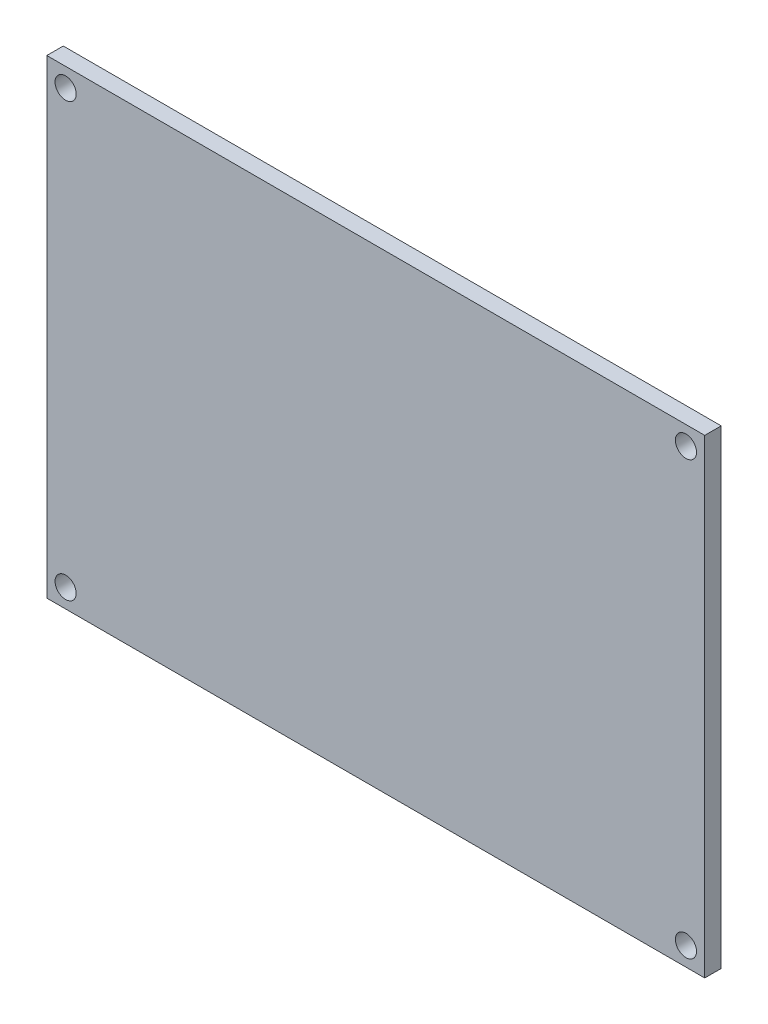
ISO-10303-21;
HEADER;
FILE_DESCRIPTION(('STEP AP214'),'2;1');
FILE_NAME('part.step','',(''),(''),'','','');
FILE_SCHEMA(('AUTOMOTIVE_DESIGN { 1 0 10303 214 1 1 1 1 }'));
ENDSEC;
DATA;
#1=APPLICATION_CONTEXT('core data for automotive mechanical design processes');
#2=APPLICATION_PROTOCOL_DEFINITION('international standard','automotive_design',2000,#1);
#3=PRODUCT_CONTEXT('',#1,'mechanical');
#4=PRODUCT('Part','Part','',(#3));
#5=PRODUCT_RELATED_PRODUCT_CATEGORY('part','',(#4));
#6=PRODUCT_DEFINITION_FORMATION('','',#4);
#7=PRODUCT_DEFINITION_CONTEXT('part definition',#1,'design');
#8=PRODUCT_DEFINITION('design','',#6,#7);
#9=PRODUCT_DEFINITION_SHAPE('','',#8);
#10=(LENGTH_UNIT() NAMED_UNIT(*) SI_UNIT(.MILLI.,.METRE.));
#11=(NAMED_UNIT(*) PLANE_ANGLE_UNIT() SI_UNIT($,.RADIAN.));
#12=(NAMED_UNIT(*) SI_UNIT($,.STERADIAN.) SOLID_ANGLE_UNIT());
#13=UNCERTAINTY_MEASURE_WITH_UNIT(LENGTH_MEASURE(1.E-05),#10,'distance_accuracy_value','');
#14=(GEOMETRIC_REPRESENTATION_CONTEXT(3) GLOBAL_UNCERTAINTY_ASSIGNED_CONTEXT((#13)) GLOBAL_UNIT_ASSIGNED_CONTEXT((#10,
#11,#12)) REPRESENTATION_CONTEXT('',''));
#15=CARTESIAN_POINT('',(0.,0.,0.));
#16=DIRECTION('',(0.,0.,1.));
#17=DIRECTION('',(1.,0.,0.));
#18=AXIS2_PLACEMENT_3D('',#15,#16,#17);
#19=CARTESIAN_POINT('',(0.,0.,1.75));
#20=DIRECTION('',(0.,0.,-1.));
#21=DIRECTION('',(-1.,0.,0.));
#22=AXIS2_PLACEMENT_3D('',#19,#20,#21);
#23=PLANE('',#22);
#24=DIRECTION('',(0.,1.,0.));
#25=VECTOR('',#24,1.);
#26=CARTESIAN_POINT('',(35.,-25.,1.75));
#27=LINE('',#26,#25);
#28=CARTESIAN_POINT('',(35.,-25.,1.75));
#29=VERTEX_POINT('',#28);
#30=CARTESIAN_POINT('',(35.,25.,1.75));
#31=VERTEX_POINT('',#30);
#32=EDGE_CURVE('E85',#29,#31,#27,.T.);
#33=ORIENTED_EDGE('',*,*,#32,.T.);
#34=DIRECTION('',(-1.,0.,0.));
#35=VECTOR('',#34,1.);
#36=CARTESIAN_POINT('',(-35.,25.,1.75));
#37=LINE('',#36,#35);
#38=CARTESIAN_POINT('',(-35.,25.,1.75));
#39=VERTEX_POINT('',#38);
#40=EDGE_CURVE('E80',#31,#39,#37,.T.);
#41=ORIENTED_EDGE('',*,*,#40,.T.);
#42=DIRECTION('',(0.,-1.,0.));
#43=VECTOR('',#42,1.);
#44=CARTESIAN_POINT('',(-35.,-25.,1.75));
#45=LINE('',#44,#43);
#46=CARTESIAN_POINT('',(-35.,-25.,1.75));
#47=VERTEX_POINT('',#46);
#48=EDGE_CURVE('E83',#39,#47,#45,.T.);
#49=ORIENTED_EDGE('',*,*,#48,.T.);
#50=DIRECTION('',(1.,0.,0.));
#51=VECTOR('',#50,1.);
#52=CARTESIAN_POINT('',(-35.,-25.,1.75));
#53=LINE('',#52,#51);
#54=EDGE_CURVE('E50',#47,#29,#53,.T.);
#55=ORIENTED_EDGE('',*,*,#54,.T.);
#56=EDGE_LOOP('',(#33,#41,#49,#55));
#57=FACE_BOUND('',#56,.T.);
#58=CARTESIAN_POINT('',(-33.,23.,1.75));
#59=DIRECTION('',(0.,0.,1.));
#60=DIRECTION('',(1.,0.,0.));
#61=AXIS2_PLACEMENT_3D('',#58,#59,#60);
#62=CIRCLE('',#61,1.125);
#63=CARTESIAN_POINT('',(-31.875,23.,1.75));
#64=VERTEX_POINT('',#63);
#65=EDGE_CURVE('E100',#64,#64,#62,.T.);
#66=ORIENTED_EDGE('',*,*,#65,.F.);
#67=EDGE_LOOP('',(#66));
#68=FACE_BOUND('',#67,.T.);
#69=CARTESIAN_POINT('',(33.,23.,1.75));
#70=DIRECTION('',(0.,0.,1.));
#71=DIRECTION('',(1.,0.,0.));
#72=AXIS2_PLACEMENT_3D('',#69,#70,#71);
#73=CIRCLE('',#72,1.125);
#74=CARTESIAN_POINT('',(34.125,23.,1.75));
#75=VERTEX_POINT('',#74);
#76=EDGE_CURVE('E115',#75,#75,#73,.T.);
#77=ORIENTED_EDGE('',*,*,#76,.F.);
#78=EDGE_LOOP('',(#77));
#79=FACE_BOUND('',#78,.T.);
#80=CARTESIAN_POINT('',(33.,-23.,1.75));
#81=DIRECTION('',(0.,0.,1.));
#82=DIRECTION('',(1.,0.,0.));
#83=AXIS2_PLACEMENT_3D('',#80,#81,#82);
#84=CIRCLE('',#83,1.125);
#85=CARTESIAN_POINT('',(34.125,-23.,1.75));
#86=VERTEX_POINT('',#85);
#87=EDGE_CURVE('E121',#86,#86,#84,.T.);
#88=ORIENTED_EDGE('',*,*,#87,.F.);
#89=EDGE_LOOP('',(#88));
#90=FACE_BOUND('',#89,.T.);
#91=CARTESIAN_POINT('',(-33.,-23.,1.75));
#92=DIRECTION('',(0.,0.,1.));
#93=DIRECTION('',(1.,0.,0.));
#94=AXIS2_PLACEMENT_3D('',#91,#92,#93);
#95=CIRCLE('',#94,1.125);
#96=CARTESIAN_POINT('',(-31.875,-23.,1.75));
#97=VERTEX_POINT('',#96);
#98=EDGE_CURVE('E127',#97,#97,#95,.T.);
#99=ORIENTED_EDGE('',*,*,#98,.F.);
#100=EDGE_LOOP('',(#99));
#101=FACE_BOUND('',#100,.T.);
#102=ADVANCED_FACE('F33',(#57,#68,#79,#90,#101),#23,.F.);
#103=CARTESIAN_POINT('',(0.,0.,0.));
#104=DIRECTION('',(0.,0.,-1.));
#105=DIRECTION('',(-1.,0.,0.));
#106=AXIS2_PLACEMENT_3D('',#103,#104,#105);
#107=PLANE('',#106);
#108=CARTESIAN_POINT('',(33.,-23.,0.));
#109=DIRECTION('',(0.,0.,1.));
#110=DIRECTION('',(1.,0.,0.));
#111=AXIS2_PLACEMENT_3D('',#108,#109,#110);
#112=CIRCLE('',#111,1.125);
#113=CARTESIAN_POINT('',(34.125,-23.,0.));
#114=VERTEX_POINT('',#113);
#115=EDGE_CURVE('E124',#114,#114,#112,.T.);
#116=ORIENTED_EDGE('',*,*,#115,.T.);
#117=EDGE_LOOP('',(#116));
#118=FACE_BOUND('',#117,.T.);
#119=CARTESIAN_POINT('',(-33.,23.,0.));
#120=DIRECTION('',(0.,0.,1.));
#121=DIRECTION('',(1.,0.,0.));
#122=AXIS2_PLACEMENT_3D('',#119,#120,#121);
#123=CIRCLE('',#122,1.125);
#124=CARTESIAN_POINT('',(-31.875,23.,0.));
#125=VERTEX_POINT('',#124);
#126=EDGE_CURVE('E112',#125,#125,#123,.T.);
#127=ORIENTED_EDGE('',*,*,#126,.T.);
#128=EDGE_LOOP('',(#127));
#129=FACE_BOUND('',#128,.T.);
#130=DIRECTION('',(0.,1.,0.));
#131=VECTOR('',#130,1.);
#132=CARTESIAN_POINT('',(35.,-25.,0.));
#133=LINE('',#132,#131);
#134=CARTESIAN_POINT('',(35.,-25.,0.));
#135=VERTEX_POINT('',#134);
#136=CARTESIAN_POINT('',(35.,25.,0.));
#137=VERTEX_POINT('',#136);
#138=EDGE_CURVE('E97',#135,#137,#133,.T.);
#139=ORIENTED_EDGE('',*,*,#138,.F.);
#140=DIRECTION('',(1.,0.,0.));
#141=VECTOR('',#140,1.);
#142=CARTESIAN_POINT('',(-35.,-25.,0.));
#143=LINE('',#142,#141);
#144=CARTESIAN_POINT('',(-35.,-25.,0.));
#145=VERTEX_POINT('',#144);
#146=EDGE_CURVE('E73',#145,#135,#143,.T.);
#147=ORIENTED_EDGE('',*,*,#146,.F.);
#148=DIRECTION('',(0.,-1.,0.));
#149=VECTOR('',#148,1.);
#150=CARTESIAN_POINT('',(-35.,-25.,0.));
#151=LINE('',#150,#149);
#152=CARTESIAN_POINT('',(-35.,25.,0.));
#153=VERTEX_POINT('',#152);
#154=EDGE_CURVE('E67',#153,#145,#151,.T.);
#155=ORIENTED_EDGE('',*,*,#154,.F.);
#156=DIRECTION('',(-1.,0.,0.));
#157=VECTOR('',#156,1.);
#158=CARTESIAN_POINT('',(-35.,25.,0.));
#159=LINE('',#158,#157);
#160=EDGE_CURVE('E89',#137,#153,#159,.T.);
#161=ORIENTED_EDGE('',*,*,#160,.F.);
#162=EDGE_LOOP('',(#139,#147,#155,#161));
#163=FACE_BOUND('',#162,.T.);
#164=CARTESIAN_POINT('',(33.,23.,0.));
#165=DIRECTION('',(0.,0.,1.));
#166=DIRECTION('',(1.,0.,0.));
#167=AXIS2_PLACEMENT_3D('',#164,#165,#166);
#168=CIRCLE('',#167,1.125);
#169=CARTESIAN_POINT('',(34.125,23.,0.));
#170=VERTEX_POINT('',#169);
#171=EDGE_CURVE('E118',#170,#170,#168,.T.);
#172=ORIENTED_EDGE('',*,*,#171,.T.);
#173=EDGE_LOOP('',(#172));
#174=FACE_BOUND('',#173,.T.);
#175=CARTESIAN_POINT('',(-33.,-23.,0.));
#176=DIRECTION('',(0.,0.,1.));
#177=DIRECTION('',(1.,0.,0.));
#178=AXIS2_PLACEMENT_3D('',#175,#176,#177);
#179=CIRCLE('',#178,1.125);
#180=CARTESIAN_POINT('',(-31.875,-23.,0.));
#181=VERTEX_POINT('',#180);
#182=EDGE_CURVE('E130',#181,#181,#179,.T.);
#183=ORIENTED_EDGE('',*,*,#182,.T.);
#184=EDGE_LOOP('',(#183));
#185=FACE_BOUND('',#184,.T.);
#186=ADVANCED_FACE('F108',(#118,#129,#163,#174,#185),#107,.T.);
#187=CARTESIAN_POINT('',(35.,-25.,1.75));
#188=DIRECTION('',(-1.,0.,0.));
#189=DIRECTION('',(0.,0.,1.));
#190=AXIS2_PLACEMENT_3D('',#187,#188,#189);
#191=PLANE('',#190);
#192=ORIENTED_EDGE('',*,*,#138,.T.);
#193=DIRECTION('',(0.,0.,-1.));
#194=VECTOR('',#193,1.);
#195=CARTESIAN_POINT('',(35.,25.,1.75));
#196=LINE('',#195,#194);
#197=EDGE_CURVE('E11',#31,#137,#196,.T.);
#198=ORIENTED_EDGE('',*,*,#197,.F.);
#199=ORIENTED_EDGE('',*,*,#32,.F.);
#200=DIRECTION('',(0.,0.,-1.));
#201=VECTOR('',#200,1.);
#202=CARTESIAN_POINT('',(35.,-25.,1.75));
#203=LINE('',#202,#201);
#204=EDGE_CURVE('E93',#29,#135,#203,.T.);
#205=ORIENTED_EDGE('',*,*,#204,.T.);
#206=EDGE_LOOP('',(#192,#198,#199,#205));
#207=FACE_BOUND('',#206,.T.);
#208=ADVANCED_FACE('F35',(#207),#191,.F.);
#209=CARTESIAN_POINT('',(-35.,25.,1.75));
#210=DIRECTION('',(0.,-1.,0.));
#211=DIRECTION('',(0.,0.,-1.));
#212=AXIS2_PLACEMENT_3D('',#209,#210,#211);
#213=PLANE('',#212);
#214=ORIENTED_EDGE('',*,*,#160,.T.);
#215=DIRECTION('',(0.,0.,-1.));
#216=VECTOR('',#215,1.);
#217=CARTESIAN_POINT('',(-35.,25.,1.75));
#218=LINE('',#217,#216);
#219=EDGE_CURVE('E42',#39,#153,#218,.T.);
#220=ORIENTED_EDGE('',*,*,#219,.F.);
#221=ORIENTED_EDGE('',*,*,#40,.F.);
#222=ORIENTED_EDGE('',*,*,#197,.T.);
#223=EDGE_LOOP('',(#214,#220,#221,#222));
#224=FACE_BOUND('',#223,.T.);
#225=ADVANCED_FACE('F88',(#224),#213,.F.);
#226=CARTESIAN_POINT('',(-35.,-25.,1.75));
#227=DIRECTION('',(1.,0.,0.));
#228=DIRECTION('',(0.,0.,-1.));
#229=AXIS2_PLACEMENT_3D('',#226,#227,#228);
#230=PLANE('',#229);
#231=ORIENTED_EDGE('',*,*,#154,.T.);
#232=DIRECTION('',(0.,0.,-1.));
#233=VECTOR('',#232,1.);
#234=CARTESIAN_POINT('',(-35.,-25.,1.75));
#235=LINE('',#234,#233);
#236=EDGE_CURVE('E90',#47,#145,#235,.T.);
#237=ORIENTED_EDGE('',*,*,#236,.F.);
#238=ORIENTED_EDGE('',*,*,#48,.F.);
#239=ORIENTED_EDGE('',*,*,#219,.T.);
#240=EDGE_LOOP('',(#231,#237,#238,#239));
#241=FACE_BOUND('',#240,.T.);
#242=ADVANCED_FACE('F91',(#241),#230,.F.);
#243=CARTESIAN_POINT('',(-35.,-25.,1.75));
#244=DIRECTION('',(0.,1.,0.));
#245=DIRECTION('',(0.,0.,1.));
#246=AXIS2_PLACEMENT_3D('',#243,#244,#245);
#247=PLANE('',#246);
#248=ORIENTED_EDGE('',*,*,#146,.T.);
#249=ORIENTED_EDGE('',*,*,#204,.F.);
#250=ORIENTED_EDGE('',*,*,#54,.F.);
#251=ORIENTED_EDGE('',*,*,#236,.T.);
#252=EDGE_LOOP('',(#248,#249,#250,#251));
#253=FACE_BOUND('',#252,.T.);
#254=ADVANCED_FACE('F105',(#253),#247,.F.);
#255=CARTESIAN_POINT('',(-33.,23.,1.75));
#256=DIRECTION('',(0.,0.,-1.));
#257=DIRECTION('',(-1.,0.,0.));
#258=AXIS2_PLACEMENT_3D('',#255,#256,#257);
#259=CYLINDRICAL_SURFACE('',#258,1.125);
#260=ORIENTED_EDGE('',*,*,#65,.T.);
#261=EDGE_LOOP('',(#260));
#262=FACE_BOUND('',#261,.T.);
#263=ORIENTED_EDGE('',*,*,#126,.F.);
#264=EDGE_LOOP('',(#263));
#265=FACE_BOUND('',#264,.T.);
#266=ADVANCED_FACE('F147',(#262,#265),#259,.F.);
#267=CARTESIAN_POINT('',(33.,23.,1.75));
#268=DIRECTION('',(0.,0.,-1.));
#269=DIRECTION('',(-1.,0.,0.));
#270=AXIS2_PLACEMENT_3D('',#267,#268,#269);
#271=CYLINDRICAL_SURFACE('',#270,1.125);
#272=ORIENTED_EDGE('',*,*,#76,.T.);
#273=EDGE_LOOP('',(#272));
#274=FACE_BOUND('',#273,.T.);
#275=ORIENTED_EDGE('',*,*,#171,.F.);
#276=EDGE_LOOP('',(#275));
#277=FACE_BOUND('',#276,.T.);
#278=ADVANCED_FACE('F193',(#274,#277),#271,.F.);
#279=CARTESIAN_POINT('',(33.,-23.,1.75));
#280=DIRECTION('',(0.,0.,-1.));
#281=DIRECTION('',(-1.,0.,0.));
#282=AXIS2_PLACEMENT_3D('',#279,#280,#281);
#283=CYLINDRICAL_SURFACE('',#282,1.125);
#284=ORIENTED_EDGE('',*,*,#87,.T.);
#285=EDGE_LOOP('',(#284));
#286=FACE_BOUND('',#285,.T.);
#287=ORIENTED_EDGE('',*,*,#115,.F.);
#288=EDGE_LOOP('',(#287));
#289=FACE_BOUND('',#288,.T.);
#290=ADVANCED_FACE('F201',(#286,#289),#283,.F.);
#291=CARTESIAN_POINT('',(-33.,-23.,1.75));
#292=DIRECTION('',(0.,0.,-1.));
#293=DIRECTION('',(-1.,0.,0.));
#294=AXIS2_PLACEMENT_3D('',#291,#292,#293);
#295=CYLINDRICAL_SURFACE('',#294,1.125);
#296=ORIENTED_EDGE('',*,*,#98,.T.);
#297=EDGE_LOOP('',(#296));
#298=FACE_BOUND('',#297,.T.);
#299=ORIENTED_EDGE('',*,*,#182,.F.);
#300=EDGE_LOOP('',(#299));
#301=FACE_BOUND('',#300,.T.);
#302=ADVANCED_FACE('F136',(#298,#301),#295,.F.);
#303=CLOSED_SHELL('',(#102,#186,#208,#225,#242,#254,#266,#278,#290,#302));
#304=MANIFOLD_SOLID_BREP('B2',#303);
#305=ADVANCED_BREP_SHAPE_REPRESENTATION('',(#18,#304),#14);
#306=SHAPE_DEFINITION_REPRESENTATION(#9,#305);
ENDSEC;
END-ISO-10303-21;
